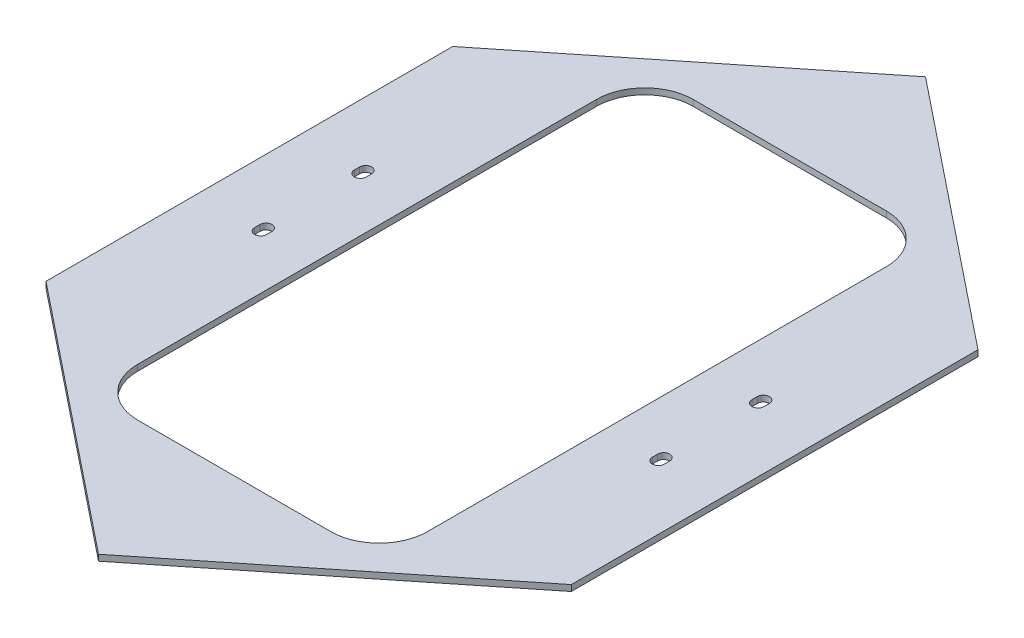
ISO-10303-21;
HEADER;
FILE_DESCRIPTION(('STEP AP214'),'2;1');
FILE_NAME('part.step','',(''),(''),'','','');
FILE_SCHEMA(('AUTOMOTIVE_DESIGN { 1 0 10303 214 1 1 1 1 }'));
ENDSEC;
DATA;
#1=APPLICATION_CONTEXT('core data for automotive mechanical design processes');
#2=APPLICATION_PROTOCOL_DEFINITION('international standard','automotive_design',2000,#1);
#3=PRODUCT_CONTEXT('',#1,'mechanical');
#4=PRODUCT('Part','Part','',(#3));
#5=PRODUCT_RELATED_PRODUCT_CATEGORY('part','',(#4));
#6=PRODUCT_DEFINITION_FORMATION('','',#4);
#7=PRODUCT_DEFINITION_CONTEXT('part definition',#1,'design');
#8=PRODUCT_DEFINITION('design','',#6,#7);
#9=PRODUCT_DEFINITION_SHAPE('','',#8);
#10=(LENGTH_UNIT() NAMED_UNIT(*) SI_UNIT(.MILLI.,.METRE.));
#11=(NAMED_UNIT(*) PLANE_ANGLE_UNIT() SI_UNIT($,.RADIAN.));
#12=(NAMED_UNIT(*) SI_UNIT($,.STERADIAN.) SOLID_ANGLE_UNIT());
#13=UNCERTAINTY_MEASURE_WITH_UNIT(LENGTH_MEASURE(1.E-05),#10,'distance_accuracy_value','');
#14=(GEOMETRIC_REPRESENTATION_CONTEXT(3) GLOBAL_UNCERTAINTY_ASSIGNED_CONTEXT((#13)) GLOBAL_UNIT_ASSIGNED_CONTEXT((#10,
#11,#12)) REPRESENTATION_CONTEXT('',''));
#15=CARTESIAN_POINT('',(0.,0.,0.));
#16=DIRECTION('',(0.,0.,1.));
#17=DIRECTION('',(1.,0.,0.));
#18=AXIS2_PLACEMENT_3D('',#15,#16,#17);
#19=CARTESIAN_POINT('',(0.,3.175,0.));
#20=DIRECTION('',(0.,-1.,0.));
#21=DIRECTION('',(0.,0.,-1.));
#22=AXIS2_PLACEMENT_3D('',#19,#20,#21);
#23=PLANE('',#22);
#24=CARTESIAN_POINT('',(209.153125,3.175,55.165625));
#25=DIRECTION('',(0.,1.,0.));
#26=DIRECTION('',(0.,0.,1.));
#27=AXIS2_PLACEMENT_3D('',#24,#25,#26);
#28=CIRCLE('',#27,6.34999999999997);
#29=CARTESIAN_POINT('',(202.803125,3.175,55.165625));
#30=VERTEX_POINT('',#29);
#31=CARTESIAN_POINT('',(215.503125,3.175,55.165625));
#32=VERTEX_POINT('',#31);
#33=EDGE_CURVE('E266',#30,#32,#28,.T.);
#34=ORIENTED_EDGE('',*,*,#33,.F.);
#35=DIRECTION('',(0.,0.,1.));
#36=VECTOR('',#35,1.);
#37=CARTESIAN_POINT('',(202.803125,3.175,55.165625));
#38=LINE('',#37,#36);
#39=CARTESIAN_POINT('',(202.803125,3.175,49.609375));
#40=VERTEX_POINT('',#39);
#41=EDGE_CURVE('E274',#40,#30,#38,.T.);
#42=ORIENTED_EDGE('',*,*,#41,.F.);
#43=CARTESIAN_POINT('',(209.153125,3.175,49.609375));
#44=DIRECTION('',(0.,1.,0.));
#45=DIRECTION('',(0.,0.,1.));
#46=AXIS2_PLACEMENT_3D('',#43,#44,#45);
#47=CIRCLE('',#46,6.34999999999997);
#48=CARTESIAN_POINT('',(215.503125,3.175,49.609375));
#49=VERTEX_POINT('',#48);
#50=EDGE_CURVE('E271',#49,#40,#47,.T.);
#51=ORIENTED_EDGE('',*,*,#50,.F.);
#52=DIRECTION('',(0.,0.,-1.));
#53=VECTOR('',#52,1.);
#54=CARTESIAN_POINT('',(215.503125,3.175,55.165625));
#55=LINE('',#54,#53);
#56=EDGE_CURVE('E268',#32,#49,#55,.T.);
#57=ORIENTED_EDGE('',*,*,#56,.F.);
#58=EDGE_LOOP('',(#34,#42,#51,#57));
#59=FACE_BOUND('',#58,.T.);
#60=CARTESIAN_POINT('',(101.6,3.175,241.3));
#61=DIRECTION('',(0.,1.,0.));
#62=DIRECTION('',(0.,0.,1.));
#63=AXIS2_PLACEMENT_3D('',#60,#61,#62);
#64=CIRCLE('',#63,50.8);
#65=CARTESIAN_POINT('',(101.6,3.175,292.1));
#66=VERTEX_POINT('',#65);
#67=CARTESIAN_POINT('',(152.4,3.175,241.3));
#68=VERTEX_POINT('',#67);
#69=EDGE_CURVE('E328',#66,#68,#64,.T.);
#70=ORIENTED_EDGE('',*,*,#69,.F.);
#71=DIRECTION('',(1.,0.,0.));
#72=VECTOR('',#71,1.);
#73=CARTESIAN_POINT('',(101.6,3.175,292.1));
#74=LINE('',#73,#72);
#75=CARTESIAN_POINT('',(-101.6,3.175,292.1));
#76=VERTEX_POINT('',#75);
#77=EDGE_CURVE('E344',#76,#66,#74,.T.);
#78=ORIENTED_EDGE('',*,*,#77,.F.);
#79=CARTESIAN_POINT('',(-101.6,3.175,241.3));
#80=DIRECTION('',(0.,1.,0.));
#81=DIRECTION('',(0.,0.,-1.));
#82=AXIS2_PLACEMENT_3D('',#79,#80,#81);
#83=CIRCLE('',#82,50.8);
#84=CARTESIAN_POINT('',(-152.4,3.175,241.3));
#85=VERTEX_POINT('',#84);
#86=EDGE_CURVE('E341',#85,#76,#83,.T.);
#87=ORIENTED_EDGE('',*,*,#86,.F.);
#88=DIRECTION('',(0.,0.,1.));
#89=VECTOR('',#88,1.);
#90=CARTESIAN_POINT('',(-152.4,3.175,241.3));
#91=LINE('',#90,#89);
#92=CARTESIAN_POINT('',(-152.4,3.175,-241.3));
#93=VERTEX_POINT('',#92);
#94=EDGE_CURVE('E339',#93,#85,#91,.T.);
#95=ORIENTED_EDGE('',*,*,#94,.F.);
#96=CARTESIAN_POINT('',(-101.6,3.175,-241.3));
#97=DIRECTION('',(0.,1.,0.));
#98=DIRECTION('',(0.,0.,1.));
#99=AXIS2_PLACEMENT_3D('',#96,#97,#98);
#100=CIRCLE('',#99,50.7999999999999);
#101=CARTESIAN_POINT('',(-101.6,3.175,-292.1));
#102=VERTEX_POINT('',#101);
#103=EDGE_CURVE('E337',#102,#93,#100,.T.);
#104=ORIENTED_EDGE('',*,*,#103,.F.);
#105=DIRECTION('',(-1.,0.,0.));
#106=VECTOR('',#105,1.);
#107=CARTESIAN_POINT('',(101.6,3.175,-292.1));
#108=LINE('',#107,#106);
#109=CARTESIAN_POINT('',(101.6,3.175,-292.1));
#110=VERTEX_POINT('',#109);
#111=EDGE_CURVE('E335',#110,#102,#108,.T.);
#112=ORIENTED_EDGE('',*,*,#111,.F.);
#113=CARTESIAN_POINT('',(101.6,3.175,-241.3));
#114=DIRECTION('',(0.,1.,0.));
#115=DIRECTION('',(0.,0.,1.));
#116=AXIS2_PLACEMENT_3D('',#113,#114,#115);
#117=CIRCLE('',#116,50.7999999999999);
#118=CARTESIAN_POINT('',(152.4,3.175,-241.3));
#119=VERTEX_POINT('',#118);
#120=EDGE_CURVE('E333',#119,#110,#117,.T.);
#121=ORIENTED_EDGE('',*,*,#120,.F.);
#122=DIRECTION('',(0.,0.,-1.));
#123=VECTOR('',#122,1.);
#124=CARTESIAN_POINT('',(152.4,3.175,241.3));
#125=LINE('',#124,#123);
#126=EDGE_CURVE('E330',#68,#119,#125,.T.);
#127=ORIENTED_EDGE('',*,*,#126,.F.);
#128=EDGE_LOOP('',(#70,#78,#87,#95,#104,#112,#121,#127));
#129=FACE_BOUND('',#128,.T.);
#130=DIRECTION('',(0.,0.,1.));
#131=VECTOR('',#130,1.);
#132=CARTESIAN_POINT('',(-276.225,3.175,213.881843));
#133=LINE('',#132,#131);
#134=CARTESIAN_POINT('',(-276.225,3.175,-213.881843));
#135=VERTEX_POINT('',#134);
#136=CARTESIAN_POINT('',(-276.225,3.175,213.881843));
#137=VERTEX_POINT('',#136);
#138=EDGE_CURVE('E418',#135,#137,#133,.T.);
#139=ORIENTED_EDGE('',*,*,#138,.T.);
#140=DIRECTION('',(0.78086880944303,0.,0.624695047554424));
#141=VECTOR('',#140,1.);
#142=CARTESIAN_POINT('',(0.,3.175,434.861843));
#143=LINE('',#142,#141);
#144=CARTESIAN_POINT('',(0.,3.175,434.861843));
#145=VERTEX_POINT('',#144);
#146=EDGE_CURVE('E421',#137,#145,#143,.T.);
#147=ORIENTED_EDGE('',*,*,#146,.T.);
#148=DIRECTION('',(0.78086880944303,0.,-0.624695047554424));
#149=VECTOR('',#148,1.);
#150=CARTESIAN_POINT('',(276.225,3.175,213.881843));
#151=LINE('',#150,#149);
#152=CARTESIAN_POINT('',(276.225,3.175,213.881843));
#153=VERTEX_POINT('',#152);
#154=EDGE_CURVE('E424',#145,#153,#151,.T.);
#155=ORIENTED_EDGE('',*,*,#154,.T.);
#156=DIRECTION('',(0.,0.,-1.));
#157=VECTOR('',#156,1.);
#158=CARTESIAN_POINT('',(276.225,3.175,213.881843));
#159=LINE('',#158,#157);
#160=CARTESIAN_POINT('',(276.225,3.175,-213.881843));
#161=VERTEX_POINT('',#160);
#162=EDGE_CURVE('E426',#153,#161,#159,.T.);
#163=ORIENTED_EDGE('',*,*,#162,.T.);
#164=DIRECTION('',(-0.78086880944303,0.,-0.624695047554424));
#165=VECTOR('',#164,1.);
#166=CARTESIAN_POINT('',(0.,3.175,-434.861843));
#167=LINE('',#166,#165);
#168=CARTESIAN_POINT('',(0.,3.175,-434.861843));
#169=VERTEX_POINT('',#168);
#170=EDGE_CURVE('E428',#161,#169,#167,.T.);
#171=ORIENTED_EDGE('',*,*,#170,.T.);
#172=DIRECTION('',(-0.78086880944303,0.,0.624695047554424));
#173=VECTOR('',#172,1.);
#174=CARTESIAN_POINT('',(-276.225,3.175,-213.881843));
#175=LINE('',#174,#173);
#176=EDGE_CURVE('E430',#169,#135,#175,.T.);
#177=ORIENTED_EDGE('',*,*,#176,.T.);
#178=EDGE_LOOP('',(#139,#147,#155,#163,#171,#177));
#179=FACE_BOUND('',#178,.T.);
#180=CARTESIAN_POINT('',(-209.153125,3.175,-55.1656249999999));
#181=DIRECTION('',(0.,1.,0.));
#182=DIRECTION('',(0.,0.,1.));
#183=AXIS2_PLACEMENT_3D('',#180,#181,#182);
#184=CIRCLE('',#183,6.34999999999997);
#185=CARTESIAN_POINT('',(-202.803125,3.175,-55.1656249999999));
#186=VERTEX_POINT('',#185);
#187=CARTESIAN_POINT('',(-215.503125,3.175,-55.1656249999998));
#188=VERTEX_POINT('',#187);
#189=EDGE_CURVE('E387',#186,#188,#184,.T.);
#190=ORIENTED_EDGE('',*,*,#189,.F.);
#191=DIRECTION('',(0.,0.,-1.));
#192=VECTOR('',#191,1.);
#193=CARTESIAN_POINT('',(-202.803125,3.175,-55.1656249999999));
#194=LINE('',#193,#192);
#195=CARTESIAN_POINT('',(-202.803125,3.175,-49.6093749999999));
#196=VERTEX_POINT('',#195);
#197=EDGE_CURVE('E395',#196,#186,#194,.T.);
#198=ORIENTED_EDGE('',*,*,#197,.F.);
#199=CARTESIAN_POINT('',(-209.153125,3.175,-49.6093749999999));
#200=DIRECTION('',(0.,1.,0.));
#201=DIRECTION('',(0.,0.,1.));
#202=AXIS2_PLACEMENT_3D('',#199,#200,#201);
#203=CIRCLE('',#202,6.34999999999997);
#204=CARTESIAN_POINT('',(-215.503125,3.175,-49.6093749999999));
#205=VERTEX_POINT('',#204);
#206=EDGE_CURVE('E392',#205,#196,#203,.T.);
#207=ORIENTED_EDGE('',*,*,#206,.F.);
#208=DIRECTION('',(0.,0.,1.));
#209=VECTOR('',#208,1.);
#210=CARTESIAN_POINT('',(-215.503125,3.175,-55.1656249999998));
#211=LINE('',#210,#209);
#212=EDGE_CURVE('E389',#188,#205,#211,.T.);
#213=ORIENTED_EDGE('',*,*,#212,.F.);
#214=EDGE_LOOP('',(#190,#198,#207,#213));
#215=FACE_BOUND('',#214,.T.);
#216=CARTESIAN_POINT('',(-209.153125,3.175,55.165625));
#217=DIRECTION('',(0.,1.,0.));
#218=DIRECTION('',(0.,0.,-1.));
#219=AXIS2_PLACEMENT_3D('',#216,#217,#218);
#220=CIRCLE('',#219,6.34999999999997);
#221=CARTESIAN_POINT('',(-215.503125,3.175,55.165625));
#222=VERTEX_POINT('',#221);
#223=CARTESIAN_POINT('',(-202.803125,3.175,55.165625));
#224=VERTEX_POINT('',#223);
#225=EDGE_CURVE('E297',#222,#224,#220,.T.);
#226=ORIENTED_EDGE('',*,*,#225,.F.);
#227=DIRECTION('',(0.,0.,1.));
#228=VECTOR('',#227,1.);
#229=CARTESIAN_POINT('',(-215.503125,3.175,55.165625));
#230=LINE('',#229,#228);
#231=CARTESIAN_POINT('',(-215.503125,3.175,49.609375));
#232=VERTEX_POINT('',#231);
#233=EDGE_CURVE('E305',#232,#222,#230,.T.);
#234=ORIENTED_EDGE('',*,*,#233,.F.);
#235=CARTESIAN_POINT('',(-209.153125,3.175,49.609375));
#236=DIRECTION('',(0.,1.,0.));
#237=DIRECTION('',(0.,0.,-1.));
#238=AXIS2_PLACEMENT_3D('',#235,#236,#237);
#239=CIRCLE('',#238,6.34999999999997);
#240=CARTESIAN_POINT('',(-202.803125,3.175,49.609375));
#241=VERTEX_POINT('',#240);
#242=EDGE_CURVE('E302',#241,#232,#239,.T.);
#243=ORIENTED_EDGE('',*,*,#242,.F.);
#244=DIRECTION('',(0.,0.,-1.));
#245=VECTOR('',#244,1.);
#246=CARTESIAN_POINT('',(-202.803125,3.175,55.165625));
#247=LINE('',#246,#245);
#248=EDGE_CURVE('E299',#224,#241,#247,.T.);
#249=ORIENTED_EDGE('',*,*,#248,.F.);
#250=EDGE_LOOP('',(#226,#234,#243,#249));
#251=FACE_BOUND('',#250,.T.);
#252=CARTESIAN_POINT('',(209.153125,3.175,-55.165625));
#253=DIRECTION('',(0.,1.,0.));
#254=DIRECTION('',(0.,0.,-1.));
#255=AXIS2_PLACEMENT_3D('',#252,#253,#254);
#256=CIRCLE('',#255,6.34999999999997);
#257=CARTESIAN_POINT('',(215.503125,3.175,-55.1656249999999));
#258=VERTEX_POINT('',#257);
#259=CARTESIAN_POINT('',(202.803125,3.175,-55.1656249999999));
#260=VERTEX_POINT('',#259);
#261=EDGE_CURVE('E230',#258,#260,#256,.T.);
#262=ORIENTED_EDGE('',*,*,#261,.F.);
#263=DIRECTION('',(0.,0.,-1.));
#264=VECTOR('',#263,1.);
#265=CARTESIAN_POINT('',(215.503125,3.175,-55.1656249999999));
#266=LINE('',#265,#264);
#267=CARTESIAN_POINT('',(215.503125,3.175,-49.609375));
#268=VERTEX_POINT('',#267);
#269=EDGE_CURVE('E252',#268,#258,#266,.T.);
#270=ORIENTED_EDGE('',*,*,#269,.F.);
#271=CARTESIAN_POINT('',(209.153125,3.175,-49.609375));
#272=DIRECTION('',(0.,1.,0.));
#273=DIRECTION('',(0.,0.,-1.));
#274=AXIS2_PLACEMENT_3D('',#271,#272,#273);
#275=CIRCLE('',#274,6.34999999999997);
#276=CARTESIAN_POINT('',(202.803125,3.175,-49.6093749999999));
#277=VERTEX_POINT('',#276);
#278=EDGE_CURVE('E250',#277,#268,#275,.T.);
#279=ORIENTED_EDGE('',*,*,#278,.F.);
#280=DIRECTION('',(0.,0.,1.));
#281=VECTOR('',#280,1.);
#282=CARTESIAN_POINT('',(202.803125,3.175,-55.1656249999999));
#283=LINE('',#282,#281);
#284=EDGE_CURVE('E238',#260,#277,#283,.T.);
#285=ORIENTED_EDGE('',*,*,#284,.F.);
#286=EDGE_LOOP('',(#262,#270,#279,#285));
#287=FACE_BOUND('',#286,.T.);
#288=ADVANCED_FACE('F33',(#59,#129,#179,#215,#251,#287),#23,.F.);
#289=CARTESIAN_POINT('',(0.,-3.175,0.));
#290=DIRECTION('',(0.,-1.,0.));
#291=DIRECTION('',(0.,0.,-1.));
#292=AXIS2_PLACEMENT_3D('',#289,#290,#291);
#293=PLANE('',#292);
#294=DIRECTION('',(0.,0.,1.));
#295=VECTOR('',#294,1.);
#296=CARTESIAN_POINT('',(-276.225,-3.175,213.881843));
#297=LINE('',#296,#295);
#298=CARTESIAN_POINT('',(-276.225,-3.175,-213.881843));
#299=VERTEX_POINT('',#298);
#300=CARTESIAN_POINT('',(-276.225,-3.175,213.881843));
#301=VERTEX_POINT('',#300);
#302=EDGE_CURVE('E417',#299,#301,#297,.T.);
#303=ORIENTED_EDGE('',*,*,#302,.F.);
#304=DIRECTION('',(-0.78086880944303,0.,0.624695047554424));
#305=VECTOR('',#304,1.);
#306=CARTESIAN_POINT('',(-276.225,-3.175,-213.881843));
#307=LINE('',#306,#305);
#308=CARTESIAN_POINT('',(0.,-3.175,-434.861843));
#309=VERTEX_POINT('',#308);
#310=EDGE_CURVE('E422',#309,#299,#307,.T.);
#311=ORIENTED_EDGE('',*,*,#310,.F.);
#312=DIRECTION('',(-0.78086880944303,0.,-0.624695047554424));
#313=VECTOR('',#312,1.);
#314=CARTESIAN_POINT('',(0.,-3.175,-434.861843));
#315=LINE('',#314,#313);
#316=CARTESIAN_POINT('',(276.225,-3.175,-213.881843));
#317=VERTEX_POINT('',#316);
#318=EDGE_CURVE('E441',#317,#309,#315,.T.);
#319=ORIENTED_EDGE('',*,*,#318,.F.);
#320=DIRECTION('',(0.,0.,-1.));
#321=VECTOR('',#320,1.);
#322=CARTESIAN_POINT('',(276.225,-3.175,213.881843));
#323=LINE('',#322,#321);
#324=CARTESIAN_POINT('',(276.225,-3.175,213.881843));
#325=VERTEX_POINT('',#324);
#326=EDGE_CURVE('E439',#325,#317,#323,.T.);
#327=ORIENTED_EDGE('',*,*,#326,.F.);
#328=DIRECTION('',(0.78086880944303,0.,-0.624695047554424));
#329=VECTOR('',#328,1.);
#330=CARTESIAN_POINT('',(276.225,-3.175,213.881843));
#331=LINE('',#330,#329);
#332=CARTESIAN_POINT('',(0.,-3.175,434.861843));
#333=VERTEX_POINT('',#332);
#334=EDGE_CURVE('E437',#333,#325,#331,.T.);
#335=ORIENTED_EDGE('',*,*,#334,.F.);
#336=DIRECTION('',(0.78086880944303,0.,0.624695047554424));
#337=VECTOR('',#336,1.);
#338=CARTESIAN_POINT('',(0.,-3.175,434.861843));
#339=LINE('',#338,#337);
#340=EDGE_CURVE('E435',#301,#333,#339,.T.);
#341=ORIENTED_EDGE('',*,*,#340,.F.);
#342=EDGE_LOOP('',(#303,#311,#319,#327,#335,#341));
#343=FACE_BOUND('',#342,.T.);
#344=DIRECTION('',(0.,0.,-1.));
#345=VECTOR('',#344,1.);
#346=CARTESIAN_POINT('',(-202.803125,-3.175,-55.1656249999999));
#347=LINE('',#346,#345);
#348=CARTESIAN_POINT('',(-202.803125,-3.175,-49.6093749999999));
#349=VERTEX_POINT('',#348);
#350=CARTESIAN_POINT('',(-202.803125,-3.175,-55.1656249999999));
#351=VERTEX_POINT('',#350);
#352=EDGE_CURVE('E390',#349,#351,#347,.T.);
#353=ORIENTED_EDGE('',*,*,#352,.T.);
#354=CARTESIAN_POINT('',(-209.153125,-3.175,-55.1656249999999));
#355=DIRECTION('',(0.,1.,0.));
#356=DIRECTION('',(0.,0.,1.));
#357=AXIS2_PLACEMENT_3D('',#354,#355,#356);
#358=CIRCLE('',#357,6.34999999999997);
#359=CARTESIAN_POINT('',(-215.503125,-3.175,-55.1656249999998));
#360=VERTEX_POINT('',#359);
#361=EDGE_CURVE('E386',#351,#360,#358,.T.);
#362=ORIENTED_EDGE('',*,*,#361,.T.);
#363=DIRECTION('',(0.,0.,1.));
#364=VECTOR('',#363,1.);
#365=CARTESIAN_POINT('',(-215.503125,-3.175,-55.1656249999998));
#366=LINE('',#365,#364);
#367=CARTESIAN_POINT('',(-215.503125,-3.175,-49.6093749999999));
#368=VERTEX_POINT('',#367);
#369=EDGE_CURVE('E400',#360,#368,#366,.T.);
#370=ORIENTED_EDGE('',*,*,#369,.T.);
#371=CARTESIAN_POINT('',(-209.153125,-3.175,-49.6093749999999));
#372=DIRECTION('',(0.,1.,0.));
#373=DIRECTION('',(0.,0.,1.));
#374=AXIS2_PLACEMENT_3D('',#371,#372,#373);
#375=CIRCLE('',#374,6.34999999999997);
#376=EDGE_CURVE('E403',#368,#349,#375,.T.);
#377=ORIENTED_EDGE('',*,*,#376,.T.);
#378=EDGE_LOOP('',(#353,#362,#370,#377));
#379=FACE_BOUND('',#378,.T.);
#380=DIRECTION('',(1.,0.,0.));
#381=VECTOR('',#380,1.);
#382=CARTESIAN_POINT('',(101.6,-3.175,292.1));
#383=LINE('',#382,#381);
#384=CARTESIAN_POINT('',(-101.6,-3.175,292.1));
#385=VERTEX_POINT('',#384);
#386=CARTESIAN_POINT('',(101.6,-3.175,292.1));
#387=VERTEX_POINT('',#386);
#388=EDGE_CURVE('E331',#385,#387,#383,.T.);
#389=ORIENTED_EDGE('',*,*,#388,.T.);
#390=CARTESIAN_POINT('',(101.6,-3.175,241.3));
#391=DIRECTION('',(0.,1.,0.));
#392=DIRECTION('',(0.,0.,1.));
#393=AXIS2_PLACEMENT_3D('',#390,#391,#392);
#394=CIRCLE('',#393,50.8);
#395=CARTESIAN_POINT('',(152.4,-3.175,241.3));
#396=VERTEX_POINT('',#395);
#397=EDGE_CURVE('E327',#387,#396,#394,.T.);
#398=ORIENTED_EDGE('',*,*,#397,.T.);
#399=DIRECTION('',(0.,0.,-1.));
#400=VECTOR('',#399,1.);
#401=CARTESIAN_POINT('',(152.4,-3.175,241.3));
#402=LINE('',#401,#400);
#403=CARTESIAN_POINT('',(152.4,-3.175,-241.3));
#404=VERTEX_POINT('',#403);
#405=EDGE_CURVE('E349',#396,#404,#402,.T.);
#406=ORIENTED_EDGE('',*,*,#405,.T.);
#407=CARTESIAN_POINT('',(101.6,-3.175,-241.3));
#408=DIRECTION('',(0.,1.,0.));
#409=DIRECTION('',(0.,0.,1.));
#410=AXIS2_PLACEMENT_3D('',#407,#408,#409);
#411=CIRCLE('',#410,50.7999999999999);
#412=CARTESIAN_POINT('',(101.6,-3.175,-292.1));
#413=VERTEX_POINT('',#412);
#414=EDGE_CURVE('E352',#404,#413,#411,.T.);
#415=ORIENTED_EDGE('',*,*,#414,.T.);
#416=DIRECTION('',(-1.,0.,0.));
#417=VECTOR('',#416,1.);
#418=CARTESIAN_POINT('',(101.6,-3.175,-292.1));
#419=LINE('',#418,#417);
#420=CARTESIAN_POINT('',(-101.6,-3.175,-292.1));
#421=VERTEX_POINT('',#420);
#422=EDGE_CURVE('E355',#413,#421,#419,.T.);
#423=ORIENTED_EDGE('',*,*,#422,.T.);
#424=CARTESIAN_POINT('',(-101.6,-3.175,-241.3));
#425=DIRECTION('',(0.,1.,0.));
#426=DIRECTION('',(0.,0.,1.));
#427=AXIS2_PLACEMENT_3D('',#424,#425,#426);
#428=CIRCLE('',#427,50.7999999999999);
#429=CARTESIAN_POINT('',(-152.4,-3.175,-241.3));
#430=VERTEX_POINT('',#429);
#431=EDGE_CURVE('E358',#421,#430,#428,.T.);
#432=ORIENTED_EDGE('',*,*,#431,.T.);
#433=DIRECTION('',(0.,0.,1.));
#434=VECTOR('',#433,1.);
#435=CARTESIAN_POINT('',(-152.4,-3.175,241.3));
#436=LINE('',#435,#434);
#437=CARTESIAN_POINT('',(-152.4,-3.175,241.3));
#438=VERTEX_POINT('',#437);
#439=EDGE_CURVE('E361',#430,#438,#436,.T.);
#440=ORIENTED_EDGE('',*,*,#439,.T.);
#441=CARTESIAN_POINT('',(-101.6,-3.175,241.3));
#442=DIRECTION('',(0.,1.,0.));
#443=DIRECTION('',(0.,0.,-1.));
#444=AXIS2_PLACEMENT_3D('',#441,#442,#443);
#445=CIRCLE('',#444,50.8);
#446=EDGE_CURVE('E364',#438,#385,#445,.T.);
#447=ORIENTED_EDGE('',*,*,#446,.T.);
#448=EDGE_LOOP('',(#389,#398,#406,#415,#423,#432,#440,#447));
#449=FACE_BOUND('',#448,.T.);
#450=DIRECTION('',(0.,0.,1.));
#451=VECTOR('',#450,1.);
#452=CARTESIAN_POINT('',(-215.503125,-3.175,55.165625));
#453=LINE('',#452,#451);
#454=CARTESIAN_POINT('',(-215.503125,-3.175,49.609375));
#455=VERTEX_POINT('',#454);
#456=CARTESIAN_POINT('',(-215.503125,-3.175,55.165625));
#457=VERTEX_POINT('',#456);
#458=EDGE_CURVE('E300',#455,#457,#453,.T.);
#459=ORIENTED_EDGE('',*,*,#458,.T.);
#460=CARTESIAN_POINT('',(-209.153125,-3.175,55.165625));
#461=DIRECTION('',(0.,1.,0.));
#462=DIRECTION('',(0.,0.,-1.));
#463=AXIS2_PLACEMENT_3D('',#460,#461,#462);
#464=CIRCLE('',#463,6.34999999999997);
#465=CARTESIAN_POINT('',(-202.803125,-3.175,55.165625));
#466=VERTEX_POINT('',#465);
#467=EDGE_CURVE('E296',#457,#466,#464,.T.);
#468=ORIENTED_EDGE('',*,*,#467,.T.);
#469=DIRECTION('',(0.,0.,-1.));
#470=VECTOR('',#469,1.);
#471=CARTESIAN_POINT('',(-202.803125,-3.175,55.165625));
#472=LINE('',#471,#470);
#473=CARTESIAN_POINT('',(-202.803125,-3.175,49.609375));
#474=VERTEX_POINT('',#473);
#475=EDGE_CURVE('E310',#466,#474,#472,.T.);
#476=ORIENTED_EDGE('',*,*,#475,.T.);
#477=CARTESIAN_POINT('',(-209.153125,-3.175,49.609375));
#478=DIRECTION('',(0.,1.,0.));
#479=DIRECTION('',(0.,0.,-1.));
#480=AXIS2_PLACEMENT_3D('',#477,#478,#479);
#481=CIRCLE('',#480,6.34999999999997);
#482=EDGE_CURVE('E313',#474,#455,#481,.T.);
#483=ORIENTED_EDGE('',*,*,#482,.T.);
#484=EDGE_LOOP('',(#459,#468,#476,#483));
#485=FACE_BOUND('',#484,.T.);
#486=DIRECTION('',(0.,0.,1.));
#487=VECTOR('',#486,1.);
#488=CARTESIAN_POINT('',(202.803125,-3.175,55.165625));
#489=LINE('',#488,#487);
#490=CARTESIAN_POINT('',(202.803125,-3.175,49.609375));
#491=VERTEX_POINT('',#490);
#492=CARTESIAN_POINT('',(202.803125,-3.175,55.165625));
#493=VERTEX_POINT('',#492);
#494=EDGE_CURVE('E269',#491,#493,#489,.T.);
#495=ORIENTED_EDGE('',*,*,#494,.T.);
#496=CARTESIAN_POINT('',(209.153125,-3.175,55.165625));
#497=DIRECTION('',(0.,1.,0.));
#498=DIRECTION('',(0.,0.,1.));
#499=AXIS2_PLACEMENT_3D('',#496,#497,#498);
#500=CIRCLE('',#499,6.34999999999997);
#501=CARTESIAN_POINT('',(215.503125,-3.175,55.165625));
#502=VERTEX_POINT('',#501);
#503=EDGE_CURVE('E246',#493,#502,#500,.T.);
#504=ORIENTED_EDGE('',*,*,#503,.T.);
#505=DIRECTION('',(0.,0.,-1.));
#506=VECTOR('',#505,1.);
#507=CARTESIAN_POINT('',(215.503125,-3.175,55.165625));
#508=LINE('',#507,#506);
#509=CARTESIAN_POINT('',(215.503125,-3.175,49.609375));
#510=VERTEX_POINT('',#509);
#511=EDGE_CURVE('E279',#502,#510,#508,.T.);
#512=ORIENTED_EDGE('',*,*,#511,.T.);
#513=CARTESIAN_POINT('',(209.153125,-3.175,49.609375));
#514=DIRECTION('',(0.,1.,0.));
#515=DIRECTION('',(0.,0.,1.));
#516=AXIS2_PLACEMENT_3D('',#513,#514,#515);
#517=CIRCLE('',#516,6.34999999999997);
#518=EDGE_CURVE('E282',#510,#491,#517,.T.);
#519=ORIENTED_EDGE('',*,*,#518,.T.);
#520=EDGE_LOOP('',(#495,#504,#512,#519));
#521=FACE_BOUND('',#520,.T.);
#522=DIRECTION('',(0.,0.,-1.));
#523=VECTOR('',#522,1.);
#524=CARTESIAN_POINT('',(215.503125,-3.175,-55.1656249999999));
#525=LINE('',#524,#523);
#526=CARTESIAN_POINT('',(215.503125,-3.175,-49.609375));
#527=VERTEX_POINT('',#526);
#528=CARTESIAN_POINT('',(215.503125,-3.175,-55.1656249999999));
#529=VERTEX_POINT('',#528);
#530=EDGE_CURVE('E239',#527,#529,#525,.T.);
#531=ORIENTED_EDGE('',*,*,#530,.T.);
#532=CARTESIAN_POINT('',(209.153125,-3.175,-55.165625));
#533=DIRECTION('',(0.,1.,0.));
#534=DIRECTION('',(0.,0.,-1.));
#535=AXIS2_PLACEMENT_3D('',#532,#533,#534);
#536=CIRCLE('',#535,6.34999999999997);
#537=CARTESIAN_POINT('',(202.803125,-3.175,-55.1656249999999));
#538=VERTEX_POINT('',#537);
#539=EDGE_CURVE('E56',#529,#538,#536,.T.);
#540=ORIENTED_EDGE('',*,*,#539,.T.);
#541=DIRECTION('',(0.,0.,1.));
#542=VECTOR('',#541,1.);
#543=CARTESIAN_POINT('',(202.803125,-3.175,-55.1656249999999));
#544=LINE('',#543,#542);
#545=CARTESIAN_POINT('',(202.803125,-3.175,-49.6093749999999));
#546=VERTEX_POINT('',#545);
#547=EDGE_CURVE('E245',#538,#546,#544,.T.);
#548=ORIENTED_EDGE('',*,*,#547,.T.);
#549=CARTESIAN_POINT('',(209.153125,-3.175,-49.609375));
#550=DIRECTION('',(0.,1.,0.));
#551=DIRECTION('',(0.,0.,-1.));
#552=AXIS2_PLACEMENT_3D('',#549,#550,#551);
#553=CIRCLE('',#552,6.34999999999997);
#554=EDGE_CURVE('E258',#546,#527,#553,.T.);
#555=ORIENTED_EDGE('',*,*,#554,.T.);
#556=EDGE_LOOP('',(#531,#540,#548,#555));
#557=FACE_BOUND('',#556,.T.);
#558=ADVANCED_FACE('F465',(#343,#379,#449,#485,#521,#557),#293,.T.);
#559=CARTESIAN_POINT('',(-276.225,3.175,213.881843));
#560=DIRECTION('',(1.,0.,0.));
#561=DIRECTION('',(0.,0.,-1.));
#562=AXIS2_PLACEMENT_3D('',#559,#560,#561);
#563=PLANE('',#562);
#564=ORIENTED_EDGE('',*,*,#302,.T.);
#565=DIRECTION('',(0.,-1.,0.));
#566=VECTOR('',#565,1.);
#567=CARTESIAN_POINT('',(-276.225,3.175,213.881843));
#568=LINE('',#567,#566);
#569=EDGE_CURVE('E11',#137,#301,#568,.T.);
#570=ORIENTED_EDGE('',*,*,#569,.F.);
#571=ORIENTED_EDGE('',*,*,#138,.F.);
#572=DIRECTION('',(0.,-1.,0.));
#573=VECTOR('',#572,1.);
#574=CARTESIAN_POINT('',(-276.225,3.175,-213.881843));
#575=LINE('',#574,#573);
#576=EDGE_CURVE('E432',#135,#299,#575,.T.);
#577=ORIENTED_EDGE('',*,*,#576,.T.);
#578=EDGE_LOOP('',(#564,#570,#571,#577));
#579=FACE_BOUND('',#578,.T.);
#580=ADVANCED_FACE('F35',(#579),#563,.F.);
#581=CARTESIAN_POINT('',(0.,3.175,434.861843));
#582=DIRECTION('',(0.624695047554424,0.,-0.78086880944303));
#583=DIRECTION('',(-0.78086880944303,0.,-0.624695047554424));
#584=AXIS2_PLACEMENT_3D('',#581,#582,#583);
#585=PLANE('',#584);
#586=ORIENTED_EDGE('',*,*,#340,.T.);
#587=DIRECTION('',(0.,-1.,0.));
#588=VECTOR('',#587,1.);
#589=CARTESIAN_POINT('',(0.,3.175,434.861843));
#590=LINE('',#589,#588);
#591=EDGE_CURVE('E41',#145,#333,#590,.T.);
#592=ORIENTED_EDGE('',*,*,#591,.F.);
#593=ORIENTED_EDGE('',*,*,#146,.F.);
#594=ORIENTED_EDGE('',*,*,#569,.T.);
#595=EDGE_LOOP('',(#586,#592,#593,#594));
#596=FACE_BOUND('',#595,.T.);
#597=ADVANCED_FACE('F483',(#596),#585,.F.);
#598=CARTESIAN_POINT('',(276.225,3.175,213.881843));
#599=DIRECTION('',(-0.624695047554424,0.,-0.78086880944303));
#600=DIRECTION('',(-0.78086880944303,0.,0.624695047554424));
#601=AXIS2_PLACEMENT_3D('',#598,#599,#600);
#602=PLANE('',#601);
#603=ORIENTED_EDGE('',*,*,#334,.T.);
#604=DIRECTION('',(0.,-1.,0.));
#605=VECTOR('',#604,1.);
#606=CARTESIAN_POINT('',(276.225,3.175,213.881843));
#607=LINE('',#606,#605);
#608=EDGE_CURVE('E452',#153,#325,#607,.T.);
#609=ORIENTED_EDGE('',*,*,#608,.F.);
#610=ORIENTED_EDGE('',*,*,#154,.F.);
#611=ORIENTED_EDGE('',*,*,#591,.T.);
#612=EDGE_LOOP('',(#603,#609,#610,#611));
#613=FACE_BOUND('',#612,.T.);
#614=ADVANCED_FACE('F459',(#613),#602,.F.);
#615=CARTESIAN_POINT('',(276.225,3.175,213.881843));
#616=DIRECTION('',(-1.,0.,0.));
#617=DIRECTION('',(0.,0.,1.));
#618=AXIS2_PLACEMENT_3D('',#615,#616,#617);
#619=PLANE('',#618);
#620=ORIENTED_EDGE('',*,*,#326,.T.);
#621=DIRECTION('',(0.,-1.,0.));
#622=VECTOR('',#621,1.);
#623=CARTESIAN_POINT('',(276.225,3.175,-213.881843));
#624=LINE('',#623,#622);
#625=EDGE_CURVE('E449',#161,#317,#624,.T.);
#626=ORIENTED_EDGE('',*,*,#625,.F.);
#627=ORIENTED_EDGE('',*,*,#162,.F.);
#628=ORIENTED_EDGE('',*,*,#608,.T.);
#629=EDGE_LOOP('',(#620,#626,#627,#628));
#630=FACE_BOUND('',#629,.T.);
#631=ADVANCED_FACE('F471',(#630),#619,.F.);
#632=CARTESIAN_POINT('',(0.,3.175,-434.861843));
#633=DIRECTION('',(-0.624695047554424,0.,0.78086880944303));
#634=DIRECTION('',(0.78086880944303,0.,0.624695047554424));
#635=AXIS2_PLACEMENT_3D('',#632,#633,#634);
#636=PLANE('',#635);
#637=ORIENTED_EDGE('',*,*,#318,.T.);
#638=DIRECTION('',(0.,-1.,0.));
#639=VECTOR('',#638,1.);
#640=CARTESIAN_POINT('',(0.,3.175,-434.861843));
#641=LINE('',#640,#639);
#642=EDGE_CURVE('E446',#169,#309,#641,.T.);
#643=ORIENTED_EDGE('',*,*,#642,.F.);
#644=ORIENTED_EDGE('',*,*,#170,.F.);
#645=ORIENTED_EDGE('',*,*,#625,.T.);
#646=EDGE_LOOP('',(#637,#643,#644,#645));
#647=FACE_BOUND('',#646,.T.);
#648=ADVANCED_FACE('F475',(#647),#636,.F.);
#649=CARTESIAN_POINT('',(-276.225,3.175,-213.881843));
#650=DIRECTION('',(0.624695047554424,0.,0.78086880944303));
#651=DIRECTION('',(0.78086880944303,0.,-0.624695047554424));
#652=AXIS2_PLACEMENT_3D('',#649,#650,#651);
#653=PLANE('',#652);
#654=ORIENTED_EDGE('',*,*,#310,.T.);
#655=ORIENTED_EDGE('',*,*,#576,.F.);
#656=ORIENTED_EDGE('',*,*,#176,.F.);
#657=ORIENTED_EDGE('',*,*,#642,.T.);
#658=EDGE_LOOP('',(#654,#655,#656,#657));
#659=FACE_BOUND('',#658,.T.);
#660=ADVANCED_FACE('F486',(#659),#653,.F.);
#661=CARTESIAN_POINT('',(-209.153125,3.175,-55.1656249999999));
#662=DIRECTION('',(0.,-1.,0.));
#663=DIRECTION('',(0.,0.,-1.));
#664=AXIS2_PLACEMENT_3D('',#661,#662,#663);
#665=CYLINDRICAL_SURFACE('',#664,6.34999999999997);
#666=ORIENTED_EDGE('',*,*,#361,.F.);
#667=DIRECTION('',(0.,-1.,0.));
#668=VECTOR('',#667,1.);
#669=CARTESIAN_POINT('',(-202.803125,3.175,-55.1656249999999));
#670=LINE('',#669,#668);
#671=EDGE_CURVE('E397',#186,#351,#670,.T.);
#672=ORIENTED_EDGE('',*,*,#671,.F.);
#673=ORIENTED_EDGE('',*,*,#189,.T.);
#674=DIRECTION('',(0.,-1.,0.));
#675=VECTOR('',#674,1.);
#676=CARTESIAN_POINT('',(-215.503125,3.175,-55.1656249999998));
#677=LINE('',#676,#675);
#678=EDGE_CURVE('E414',#188,#360,#677,.T.);
#679=ORIENTED_EDGE('',*,*,#678,.T.);
#680=EDGE_LOOP('',(#666,#672,#673,#679));
#681=FACE_BOUND('',#680,.T.);
#682=ADVANCED_FACE('F488',(#681),#665,.F.);
#683=CARTESIAN_POINT('',(-215.503125,3.175,-55.1656249999998));
#684=DIRECTION('',(1.,0.,0.));
#685=DIRECTION('',(0.,0.,-1.));
#686=AXIS2_PLACEMENT_3D('',#683,#684,#685);
#687=PLANE('',#686);
#688=ORIENTED_EDGE('',*,*,#369,.F.);
#689=ORIENTED_EDGE('',*,*,#678,.F.);
#690=ORIENTED_EDGE('',*,*,#212,.T.);
#691=DIRECTION('',(0.,-1.,0.));
#692=VECTOR('',#691,1.);
#693=CARTESIAN_POINT('',(-215.503125,3.175,-49.6093749999999));
#694=LINE('',#693,#692);
#695=EDGE_CURVE('E412',#205,#368,#694,.T.);
#696=ORIENTED_EDGE('',*,*,#695,.T.);
#697=EDGE_LOOP('',(#688,#689,#690,#696));
#698=FACE_BOUND('',#697,.T.);
#699=ADVANCED_FACE('F494',(#698),#687,.T.);
#700=CARTESIAN_POINT('',(-209.153125,3.175,-49.6093749999999));
#701=DIRECTION('',(0.,-1.,0.));
#702=DIRECTION('',(0.,0.,-1.));
#703=AXIS2_PLACEMENT_3D('',#700,#701,#702);
#704=CYLINDRICAL_SURFACE('',#703,6.34999999999997);
#705=ORIENTED_EDGE('',*,*,#376,.F.);
#706=ORIENTED_EDGE('',*,*,#695,.F.);
#707=ORIENTED_EDGE('',*,*,#206,.T.);
#708=DIRECTION('',(0.,-1.,0.));
#709=VECTOR('',#708,1.);
#710=CARTESIAN_POINT('',(-202.803125,3.175,-49.6093749999999));
#711=LINE('',#710,#709);
#712=EDGE_CURVE('E410',#196,#349,#711,.T.);
#713=ORIENTED_EDGE('',*,*,#712,.T.);
#714=EDGE_LOOP('',(#705,#706,#707,#713));
#715=FACE_BOUND('',#714,.T.);
#716=ADVANCED_FACE('F510',(#715),#704,.F.);
#717=CARTESIAN_POINT('',(-202.803125,3.175,-55.1656249999999));
#718=DIRECTION('',(-1.,0.,0.));
#719=DIRECTION('',(0.,0.,1.));
#720=AXIS2_PLACEMENT_3D('',#717,#718,#719);
#721=PLANE('',#720);
#722=ORIENTED_EDGE('',*,*,#352,.F.);
#723=ORIENTED_EDGE('',*,*,#712,.F.);
#724=ORIENTED_EDGE('',*,*,#197,.T.);
#725=ORIENTED_EDGE('',*,*,#671,.T.);
#726=EDGE_LOOP('',(#722,#723,#724,#725));
#727=FACE_BOUND('',#726,.T.);
#728=ADVANCED_FACE('F514',(#727),#721,.T.);
#729=CARTESIAN_POINT('',(101.6,3.175,241.3));
#730=DIRECTION('',(0.,-1.,0.));
#731=DIRECTION('',(0.,0.,-1.));
#732=AXIS2_PLACEMENT_3D('',#729,#730,#731);
#733=CYLINDRICAL_SURFACE('',#732,50.8);
#734=ORIENTED_EDGE('',*,*,#397,.F.);
#735=DIRECTION('',(0.,-1.,0.));
#736=VECTOR('',#735,1.);
#737=CARTESIAN_POINT('',(101.6,3.175,292.1));
#738=LINE('',#737,#736);
#739=EDGE_CURVE('E346',#66,#387,#738,.T.);
#740=ORIENTED_EDGE('',*,*,#739,.F.);
#741=ORIENTED_EDGE('',*,*,#69,.T.);
#742=DIRECTION('',(0.,-1.,0.));
#743=VECTOR('',#742,1.);
#744=CARTESIAN_POINT('',(152.4,3.175,241.3));
#745=LINE('',#744,#743);
#746=EDGE_CURVE('E383',#68,#396,#745,.T.);
#747=ORIENTED_EDGE('',*,*,#746,.T.);
#748=EDGE_LOOP('',(#734,#740,#741,#747));
#749=FACE_BOUND('',#748,.T.);
#750=ADVANCED_FACE('F518',(#749),#733,.F.);
#751=CARTESIAN_POINT('',(152.4,3.175,241.3));
#752=DIRECTION('',(-1.,0.,0.));
#753=DIRECTION('',(0.,0.,1.));
#754=AXIS2_PLACEMENT_3D('',#751,#752,#753);
#755=PLANE('',#754);
#756=ORIENTED_EDGE('',*,*,#405,.F.);
#757=ORIENTED_EDGE('',*,*,#746,.F.);
#758=ORIENTED_EDGE('',*,*,#126,.T.);
#759=DIRECTION('',(0.,-1.,0.));
#760=VECTOR('',#759,1.);
#761=CARTESIAN_POINT('',(152.4,3.175,-241.3));
#762=LINE('',#761,#760);
#763=EDGE_CURVE('E381',#119,#404,#762,.T.);
#764=ORIENTED_EDGE('',*,*,#763,.T.);
#765=EDGE_LOOP('',(#756,#757,#758,#764));
#766=FACE_BOUND('',#765,.T.);
#767=ADVANCED_FACE('F522',(#766),#755,.T.);
#768=CARTESIAN_POINT('',(101.6,3.175,-241.3));
#769=DIRECTION('',(0.,-1.,0.));
#770=DIRECTION('',(0.,0.,-1.));
#771=AXIS2_PLACEMENT_3D('',#768,#769,#770);
#772=CYLINDRICAL_SURFACE('',#771,50.7999999999999);
#773=ORIENTED_EDGE('',*,*,#414,.F.);
#774=ORIENTED_EDGE('',*,*,#763,.F.);
#775=ORIENTED_EDGE('',*,*,#120,.T.);
#776=DIRECTION('',(0.,-1.,0.));
#777=VECTOR('',#776,1.);
#778=CARTESIAN_POINT('',(101.6,3.175,-292.1));
#779=LINE('',#778,#777);
#780=EDGE_CURVE('E379',#110,#413,#779,.T.);
#781=ORIENTED_EDGE('',*,*,#780,.T.);
#782=EDGE_LOOP('',(#773,#774,#775,#781));
#783=FACE_BOUND('',#782,.T.);
#784=ADVANCED_FACE('F526',(#783),#772,.F.);
#785=CARTESIAN_POINT('',(101.6,3.175,-292.1));
#786=DIRECTION('',(0.,0.,1.));
#787=DIRECTION('',(1.,0.,0.));
#788=AXIS2_PLACEMENT_3D('',#785,#786,#787);
#789=PLANE('',#788);
#790=ORIENTED_EDGE('',*,*,#422,.F.);
#791=ORIENTED_EDGE('',*,*,#780,.F.);
#792=ORIENTED_EDGE('',*,*,#111,.T.);
#793=DIRECTION('',(0.,-1.,0.));
#794=VECTOR('',#793,1.);
#795=CARTESIAN_POINT('',(-101.6,3.175,-292.1));
#796=LINE('',#795,#794);
#797=EDGE_CURVE('E377',#102,#421,#796,.T.);
#798=ORIENTED_EDGE('',*,*,#797,.T.);
#799=EDGE_LOOP('',(#790,#791,#792,#798));
#800=FACE_BOUND('',#799,.T.);
#801=ADVANCED_FACE('F530',(#800),#789,.T.);
#802=CARTESIAN_POINT('',(-101.6,3.175,-241.3));
#803=DIRECTION('',(0.,-1.,0.));
#804=DIRECTION('',(0.,0.,-1.));
#805=AXIS2_PLACEMENT_3D('',#802,#803,#804);
#806=CYLINDRICAL_SURFACE('',#805,50.7999999999999);
#807=ORIENTED_EDGE('',*,*,#431,.F.);
#808=ORIENTED_EDGE('',*,*,#797,.F.);
#809=ORIENTED_EDGE('',*,*,#103,.T.);
#810=DIRECTION('',(0.,-1.,0.));
#811=VECTOR('',#810,1.);
#812=CARTESIAN_POINT('',(-152.4,3.175,-241.3));
#813=LINE('',#812,#811);
#814=EDGE_CURVE('E375',#93,#430,#813,.T.);
#815=ORIENTED_EDGE('',*,*,#814,.T.);
#816=EDGE_LOOP('',(#807,#808,#809,#815));
#817=FACE_BOUND('',#816,.T.);
#818=ADVANCED_FACE('F534',(#817),#806,.F.);
#819=CARTESIAN_POINT('',(-152.4,3.175,241.3));
#820=DIRECTION('',(1.,0.,0.));
#821=DIRECTION('',(0.,0.,-1.));
#822=AXIS2_PLACEMENT_3D('',#819,#820,#821);
#823=PLANE('',#822);
#824=ORIENTED_EDGE('',*,*,#439,.F.);
#825=ORIENTED_EDGE('',*,*,#814,.F.);
#826=ORIENTED_EDGE('',*,*,#94,.T.);
#827=DIRECTION('',(0.,-1.,0.));
#828=VECTOR('',#827,1.);
#829=CARTESIAN_POINT('',(-152.4,3.175,241.3));
#830=LINE('',#829,#828);
#831=EDGE_CURVE('E373',#85,#438,#830,.T.);
#832=ORIENTED_EDGE('',*,*,#831,.T.);
#833=EDGE_LOOP('',(#824,#825,#826,#832));
#834=FACE_BOUND('',#833,.T.);
#835=ADVANCED_FACE('F538',(#834),#823,.T.);
#836=CARTESIAN_POINT('',(-101.6,3.175,241.3));
#837=DIRECTION('',(0.,-1.,0.));
#838=DIRECTION('',(0.,0.,-1.));
#839=AXIS2_PLACEMENT_3D('',#836,#837,#838);
#840=CYLINDRICAL_SURFACE('',#839,50.8);
#841=ORIENTED_EDGE('',*,*,#446,.F.);
#842=ORIENTED_EDGE('',*,*,#831,.F.);
#843=ORIENTED_EDGE('',*,*,#86,.T.);
#844=DIRECTION('',(0.,-1.,0.));
#845=VECTOR('',#844,1.);
#846=CARTESIAN_POINT('',(-101.6,3.175,292.1));
#847=LINE('',#846,#845);
#848=EDGE_CURVE('E371',#76,#385,#847,.T.);
#849=ORIENTED_EDGE('',*,*,#848,.T.);
#850=EDGE_LOOP('',(#841,#842,#843,#849));
#851=FACE_BOUND('',#850,.T.);
#852=ADVANCED_FACE('F542',(#851),#840,.F.);
#853=CARTESIAN_POINT('',(101.6,3.175,292.1));
#854=DIRECTION('',(0.,0.,-1.));
#855=DIRECTION('',(-1.,0.,0.));
#856=AXIS2_PLACEMENT_3D('',#853,#854,#855);
#857=PLANE('',#856);
#858=ORIENTED_EDGE('',*,*,#388,.F.);
#859=ORIENTED_EDGE('',*,*,#848,.F.);
#860=ORIENTED_EDGE('',*,*,#77,.T.);
#861=ORIENTED_EDGE('',*,*,#739,.T.);
#862=EDGE_LOOP('',(#858,#859,#860,#861));
#863=FACE_BOUND('',#862,.T.);
#864=ADVANCED_FACE('F546',(#863),#857,.T.);
#865=CARTESIAN_POINT('',(-209.153125,3.175,55.165625));
#866=DIRECTION('',(0.,-1.,0.));
#867=DIRECTION('',(0.,0.,-1.));
#868=AXIS2_PLACEMENT_3D('',#865,#866,#867);
#869=CYLINDRICAL_SURFACE('',#868,6.34999999999997);
#870=ORIENTED_EDGE('',*,*,#467,.F.);
#871=DIRECTION('',(0.,-1.,0.));
#872=VECTOR('',#871,1.);
#873=CARTESIAN_POINT('',(-215.503125,3.175,55.165625));
#874=LINE('',#873,#872);
#875=EDGE_CURVE('E307',#222,#457,#874,.T.);
#876=ORIENTED_EDGE('',*,*,#875,.F.);
#877=ORIENTED_EDGE('',*,*,#225,.T.);
#878=DIRECTION('',(0.,-1.,0.));
#879=VECTOR('',#878,1.);
#880=CARTESIAN_POINT('',(-202.803125,3.175,55.165625));
#881=LINE('',#880,#879);
#882=EDGE_CURVE('E324',#224,#466,#881,.T.);
#883=ORIENTED_EDGE('',*,*,#882,.T.);
#884=EDGE_LOOP('',(#870,#876,#877,#883));
#885=FACE_BOUND('',#884,.T.);
#886=ADVANCED_FACE('F550',(#885),#869,.F.);
#887=CARTESIAN_POINT('',(-202.803125,3.175,55.165625));
#888=DIRECTION('',(-1.,0.,0.));
#889=DIRECTION('',(0.,0.,1.));
#890=AXIS2_PLACEMENT_3D('',#887,#888,#889);
#891=PLANE('',#890);
#892=ORIENTED_EDGE('',*,*,#475,.F.);
#893=ORIENTED_EDGE('',*,*,#882,.F.);
#894=ORIENTED_EDGE('',*,*,#248,.T.);
#895=DIRECTION('',(0.,-1.,0.));
#896=VECTOR('',#895,1.);
#897=CARTESIAN_POINT('',(-202.803125,3.175,49.609375));
#898=LINE('',#897,#896);
#899=EDGE_CURVE('E322',#241,#474,#898,.T.);
#900=ORIENTED_EDGE('',*,*,#899,.T.);
#901=EDGE_LOOP('',(#892,#893,#894,#900));
#902=FACE_BOUND('',#901,.T.);
#903=ADVANCED_FACE('F554',(#902),#891,.T.);
#904=CARTESIAN_POINT('',(-209.153125,3.175,49.609375));
#905=DIRECTION('',(0.,-1.,0.));
#906=DIRECTION('',(0.,0.,-1.));
#907=AXIS2_PLACEMENT_3D('',#904,#905,#906);
#908=CYLINDRICAL_SURFACE('',#907,6.34999999999997);
#909=ORIENTED_EDGE('',*,*,#482,.F.);
#910=ORIENTED_EDGE('',*,*,#899,.F.);
#911=ORIENTED_EDGE('',*,*,#242,.T.);
#912=DIRECTION('',(0.,-1.,0.));
#913=VECTOR('',#912,1.);
#914=CARTESIAN_POINT('',(-215.503125,3.175,49.609375));
#915=LINE('',#914,#913);
#916=EDGE_CURVE('E320',#232,#455,#915,.T.);
#917=ORIENTED_EDGE('',*,*,#916,.T.);
#918=EDGE_LOOP('',(#909,#910,#911,#917));
#919=FACE_BOUND('',#918,.T.);
#920=ADVANCED_FACE('F558',(#919),#908,.F.);
#921=CARTESIAN_POINT('',(-215.503125,3.175,55.165625));
#922=DIRECTION('',(1.,0.,0.));
#923=DIRECTION('',(0.,0.,-1.));
#924=AXIS2_PLACEMENT_3D('',#921,#922,#923);
#925=PLANE('',#924);
#926=ORIENTED_EDGE('',*,*,#458,.F.);
#927=ORIENTED_EDGE('',*,*,#916,.F.);
#928=ORIENTED_EDGE('',*,*,#233,.T.);
#929=ORIENTED_EDGE('',*,*,#875,.T.);
#930=EDGE_LOOP('',(#926,#927,#928,#929));
#931=FACE_BOUND('',#930,.T.);
#932=ADVANCED_FACE('F562',(#931),#925,.T.);
#933=CARTESIAN_POINT('',(209.153125,3.175,55.165625));
#934=DIRECTION('',(0.,-1.,0.));
#935=DIRECTION('',(0.,0.,-1.));
#936=AXIS2_PLACEMENT_3D('',#933,#934,#935);
#937=CYLINDRICAL_SURFACE('',#936,6.34999999999997);
#938=ORIENTED_EDGE('',*,*,#503,.F.);
#939=DIRECTION('',(0.,-1.,0.));
#940=VECTOR('',#939,1.);
#941=CARTESIAN_POINT('',(202.803125,3.175,55.165625));
#942=LINE('',#941,#940);
#943=EDGE_CURVE('E276',#30,#493,#942,.T.);
#944=ORIENTED_EDGE('',*,*,#943,.F.);
#945=ORIENTED_EDGE('',*,*,#33,.T.);
#946=DIRECTION('',(0.,-1.,0.));
#947=VECTOR('',#946,1.);
#948=CARTESIAN_POINT('',(215.503125,3.175,55.165625));
#949=LINE('',#948,#947);
#950=EDGE_CURVE('E293',#32,#502,#949,.T.);
#951=ORIENTED_EDGE('',*,*,#950,.T.);
#952=EDGE_LOOP('',(#938,#944,#945,#951));
#953=FACE_BOUND('',#952,.T.);
#954=ADVANCED_FACE('F566',(#953),#937,.F.);
#955=CARTESIAN_POINT('',(215.503125,3.175,55.165625));
#956=DIRECTION('',(-1.,0.,0.));
#957=DIRECTION('',(0.,0.,1.));
#958=AXIS2_PLACEMENT_3D('',#955,#956,#957);
#959=PLANE('',#958);
#960=ORIENTED_EDGE('',*,*,#511,.F.);
#961=ORIENTED_EDGE('',*,*,#950,.F.);
#962=ORIENTED_EDGE('',*,*,#56,.T.);
#963=DIRECTION('',(0.,-1.,0.));
#964=VECTOR('',#963,1.);
#965=CARTESIAN_POINT('',(215.503125,3.175,49.609375));
#966=LINE('',#965,#964);
#967=EDGE_CURVE('E291',#49,#510,#966,.T.);
#968=ORIENTED_EDGE('',*,*,#967,.T.);
#969=EDGE_LOOP('',(#960,#961,#962,#968));
#970=FACE_BOUND('',#969,.T.);
#971=ADVANCED_FACE('F570',(#970),#959,.T.);
#972=CARTESIAN_POINT('',(209.153125,3.175,49.609375));
#973=DIRECTION('',(0.,-1.,0.));
#974=DIRECTION('',(0.,0.,-1.));
#975=AXIS2_PLACEMENT_3D('',#972,#973,#974);
#976=CYLINDRICAL_SURFACE('',#975,6.34999999999997);
#977=ORIENTED_EDGE('',*,*,#518,.F.);
#978=ORIENTED_EDGE('',*,*,#967,.F.);
#979=ORIENTED_EDGE('',*,*,#50,.T.);
#980=DIRECTION('',(0.,-1.,0.));
#981=VECTOR('',#980,1.);
#982=CARTESIAN_POINT('',(202.803125,3.175,49.609375));
#983=LINE('',#982,#981);
#984=EDGE_CURVE('E289',#40,#491,#983,.T.);
#985=ORIENTED_EDGE('',*,*,#984,.T.);
#986=EDGE_LOOP('',(#977,#978,#979,#985));
#987=FACE_BOUND('',#986,.T.);
#988=ADVANCED_FACE('F574',(#987),#976,.F.);
#989=CARTESIAN_POINT('',(202.803125,3.175,55.165625));
#990=DIRECTION('',(1.,0.,0.));
#991=DIRECTION('',(0.,0.,-1.));
#992=AXIS2_PLACEMENT_3D('',#989,#990,#991);
#993=PLANE('',#992);
#994=ORIENTED_EDGE('',*,*,#494,.F.);
#995=ORIENTED_EDGE('',*,*,#984,.F.);
#996=ORIENTED_EDGE('',*,*,#41,.T.);
#997=ORIENTED_EDGE('',*,*,#943,.T.);
#998=EDGE_LOOP('',(#994,#995,#996,#997));
#999=FACE_BOUND('',#998,.T.);
#1000=ADVANCED_FACE('F578',(#999),#993,.T.);
#1001=CARTESIAN_POINT('',(209.153125,3.175,-55.165625));
#1002=DIRECTION('',(0.,-1.,0.));
#1003=DIRECTION('',(0.,0.,-1.));
#1004=AXIS2_PLACEMENT_3D('',#1001,#1002,#1003);
#1005=CYLINDRICAL_SURFACE('',#1004,6.34999999999997);
#1006=ORIENTED_EDGE('',*,*,#539,.F.);
#1007=DIRECTION('',(0.,-1.,0.));
#1008=VECTOR('',#1007,1.);
#1009=CARTESIAN_POINT('',(215.503125,3.175,-55.1656249999999));
#1010=LINE('',#1009,#1008);
#1011=EDGE_CURVE('E234',#258,#529,#1010,.T.);
#1012=ORIENTED_EDGE('',*,*,#1011,.F.);
#1013=ORIENTED_EDGE('',*,*,#261,.T.);
#1014=DIRECTION('',(0.,-1.,0.));
#1015=VECTOR('',#1014,1.);
#1016=CARTESIAN_POINT('',(202.803125,3.175,-55.1656249999999));
#1017=LINE('',#1016,#1015);
#1018=EDGE_CURVE('E233',#260,#538,#1017,.T.);
#1019=ORIENTED_EDGE('',*,*,#1018,.T.);
#1020=EDGE_LOOP('',(#1006,#1012,#1013,#1019));
#1021=FACE_BOUND('',#1020,.T.);
#1022=ADVANCED_FACE('F232',(#1021),#1005,.F.);
#1023=CARTESIAN_POINT('',(202.803125,3.175,-55.1656249999999));
#1024=DIRECTION('',(1.,0.,0.));
#1025=DIRECTION('',(0.,0.,-1.));
#1026=AXIS2_PLACEMENT_3D('',#1023,#1024,#1025);
#1027=PLANE('',#1026);
#1028=ORIENTED_EDGE('',*,*,#547,.F.);
#1029=ORIENTED_EDGE('',*,*,#1018,.F.);
#1030=ORIENTED_EDGE('',*,*,#284,.T.);
#1031=DIRECTION('',(0.,-1.,0.));
#1032=VECTOR('',#1031,1.);
#1033=CARTESIAN_POINT('',(202.803125,3.175,-49.6093749999999));
#1034=LINE('',#1033,#1032);
#1035=EDGE_CURVE('E247',#277,#546,#1034,.T.);
#1036=ORIENTED_EDGE('',*,*,#1035,.T.);
#1037=EDGE_LOOP('',(#1028,#1029,#1030,#1036));
#1038=FACE_BOUND('',#1037,.T.);
#1039=ADVANCED_FACE('F242',(#1038),#1027,.T.);
#1040=CARTESIAN_POINT('',(209.153125,3.175,-49.609375));
#1041=DIRECTION('',(0.,-1.,0.));
#1042=DIRECTION('',(0.,0.,-1.));
#1043=AXIS2_PLACEMENT_3D('',#1040,#1041,#1042);
#1044=CYLINDRICAL_SURFACE('',#1043,6.34999999999997);
#1045=ORIENTED_EDGE('',*,*,#554,.F.);
#1046=ORIENTED_EDGE('',*,*,#1035,.F.);
#1047=ORIENTED_EDGE('',*,*,#278,.T.);
#1048=DIRECTION('',(0.,-1.,0.));
#1049=VECTOR('',#1048,1.);
#1050=CARTESIAN_POINT('',(215.503125,3.175,-49.609375));
#1051=LINE('',#1050,#1049);
#1052=EDGE_CURVE('E48',#268,#527,#1051,.T.);
#1053=ORIENTED_EDGE('',*,*,#1052,.T.);
#1054=EDGE_LOOP('',(#1045,#1046,#1047,#1053));
#1055=FACE_BOUND('',#1054,.T.);
#1056=ADVANCED_FACE('F587',(#1055),#1044,.F.);
#1057=CARTESIAN_POINT('',(215.503125,3.175,-55.1656249999999));
#1058=DIRECTION('',(-1.,0.,0.));
#1059=DIRECTION('',(0.,0.,1.));
#1060=AXIS2_PLACEMENT_3D('',#1057,#1058,#1059);
#1061=PLANE('',#1060);
#1062=ORIENTED_EDGE('',*,*,#530,.F.);
#1063=ORIENTED_EDGE('',*,*,#1052,.F.);
#1064=ORIENTED_EDGE('',*,*,#269,.T.);
#1065=ORIENTED_EDGE('',*,*,#1011,.T.);
#1066=EDGE_LOOP('',(#1062,#1063,#1064,#1065));
#1067=FACE_BOUND('',#1066,.T.);
#1068=ADVANCED_FACE('F590',(#1067),#1061,.T.);
#1069=CLOSED_SHELL('',(#288,#558,#580,#597,#614,#631,#648,#660,#682,#699,#716,#728,#750,#767,
#784,#801,#818,#835,#852,#864,#886,#903,#920,#932,#954,#971,#988,#1000,#1022,#1039,#1056,#1068));
#1070=MANIFOLD_SOLID_BREP('B2',#1069);
#1071=ADVANCED_BREP_SHAPE_REPRESENTATION('',(#18,#1070),#14);
#1072=SHAPE_DEFINITION_REPRESENTATION(#9,#1071);
ENDSEC;
END-ISO-10303-21;
